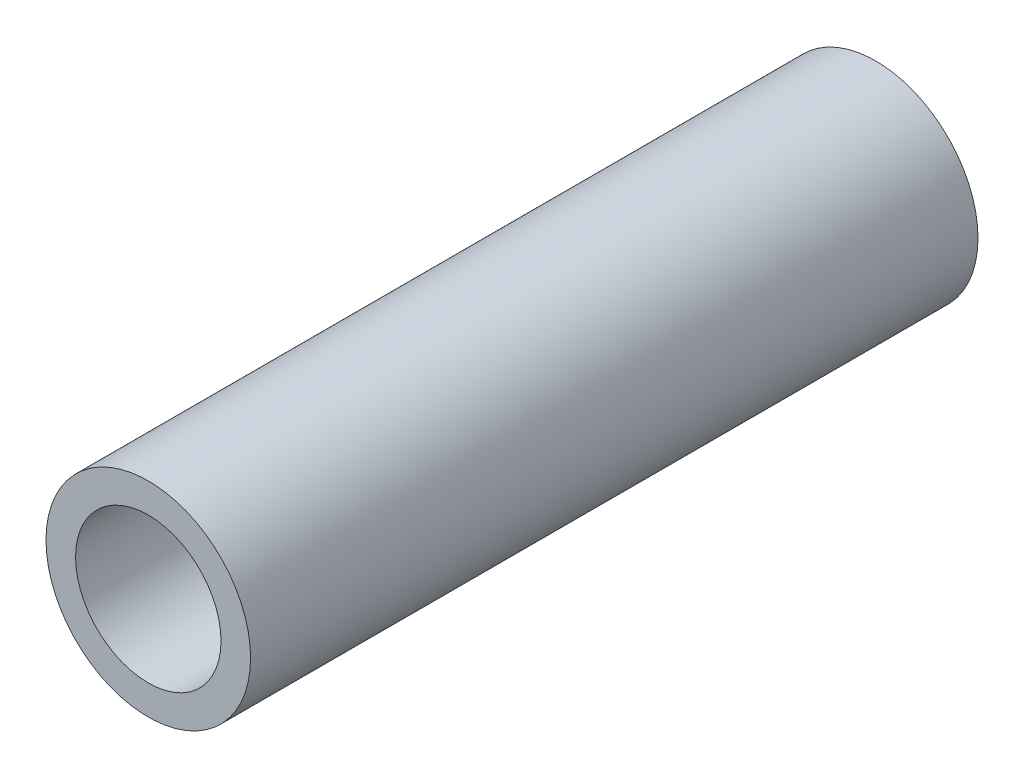
ISO-10303-21;
HEADER;
FILE_DESCRIPTION(('STEP AP214'),'2;1');
FILE_NAME('part.step','',(''),(''),'','','');
FILE_SCHEMA(('AUTOMOTIVE_DESIGN { 1 0 10303 214 1 1 1 1 }'));
ENDSEC;
DATA;
#1=APPLICATION_CONTEXT('core data for automotive mechanical design processes');
#2=APPLICATION_PROTOCOL_DEFINITION('international standard','automotive_design',2000,#1);
#3=PRODUCT_CONTEXT('',#1,'mechanical');
#4=PRODUCT('Part','Part','',(#3));
#5=PRODUCT_RELATED_PRODUCT_CATEGORY('part','',(#4));
#6=PRODUCT_DEFINITION_FORMATION('','',#4);
#7=PRODUCT_DEFINITION_CONTEXT('part definition',#1,'design');
#8=PRODUCT_DEFINITION('design','',#6,#7);
#9=PRODUCT_DEFINITION_SHAPE('','',#8);
#10=(LENGTH_UNIT() NAMED_UNIT(*) SI_UNIT(.MILLI.,.METRE.));
#11=(NAMED_UNIT(*) PLANE_ANGLE_UNIT() SI_UNIT($,.RADIAN.));
#12=(NAMED_UNIT(*) SI_UNIT($,.STERADIAN.) SOLID_ANGLE_UNIT());
#13=UNCERTAINTY_MEASURE_WITH_UNIT(LENGTH_MEASURE(1.E-05),#10,'distance_accuracy_value','');
#14=(GEOMETRIC_REPRESENTATION_CONTEXT(3) GLOBAL_UNCERTAINTY_ASSIGNED_CONTEXT((#13)) GLOBAL_UNIT_ASSIGNED_CONTEXT((#10,
#11,#12)) REPRESENTATION_CONTEXT('',''));
#15=CARTESIAN_POINT('',(0.,0.,0.));
#16=DIRECTION('',(0.,0.,1.));
#17=DIRECTION('',(1.,0.,0.));
#18=AXIS2_PLACEMENT_3D('',#15,#16,#17);
#19=CARTESIAN_POINT('',(0.,0.,8.));
#20=DIRECTION('',(0.,0.,-1.));
#21=DIRECTION('',(-1.,0.,0.));
#22=AXIS2_PLACEMENT_3D('',#19,#20,#21);
#23=CYLINDRICAL_SURFACE('',#22,1.6);
#24=CARTESIAN_POINT('',(0.,0.,8.));
#25=DIRECTION('',(0.,0.,1.));
#26=DIRECTION('',(1.,0.,0.));
#27=AXIS2_PLACEMENT_3D('',#24,#25,#26);
#28=CIRCLE('',#27,1.6);
#29=CARTESIAN_POINT('',(-1.6,0.,8.));
#30=VERTEX_POINT('',#29);
#31=CARTESIAN_POINT('',(1.6,0.,8.));
#32=VERTEX_POINT('',#31);
#33=EDGE_CURVE('E10',#30,#32,#28,.T.);
#34=ORIENTED_EDGE('',*,*,#33,.T.);
#35=DIRECTION('',(0.,0.,-1.));
#36=VECTOR('',#35,1.);
#37=CARTESIAN_POINT('',(1.6,0.,8.));
#38=LINE('',#37,#36);
#39=CARTESIAN_POINT('',(1.6,0.,-8.));
#40=VERTEX_POINT('',#39);
#41=EDGE_CURVE('E26',#32,#40,#38,.T.);
#42=ORIENTED_EDGE('',*,*,#41,.T.);
#43=CARTESIAN_POINT('',(0.,0.,-8.));
#44=DIRECTION('',(0.,0.,1.));
#45=DIRECTION('',(1.,0.,0.));
#46=AXIS2_PLACEMENT_3D('',#43,#44,#45);
#47=CIRCLE('',#46,1.6);
#48=CARTESIAN_POINT('',(-1.6,0.,-8.));
#49=VERTEX_POINT('',#48);
#50=EDGE_CURVE('E49',#49,#40,#47,.T.);
#51=ORIENTED_EDGE('',*,*,#50,.F.);
#52=CARTESIAN_POINT('',(0.,0.,-8.));
#53=DIRECTION('',(0.,0.,1.));
#54=DIRECTION('',(1.,0.,0.));
#55=AXIS2_PLACEMENT_3D('',#52,#53,#54);
#56=CIRCLE('',#55,1.6);
#57=EDGE_CURVE('E101',#40,#49,#56,.T.);
#58=ORIENTED_EDGE('',*,*,#57,.F.);
#59=ORIENTED_EDGE('',*,*,#41,.F.);
#60=CARTESIAN_POINT('',(0.,0.,8.));
#61=DIRECTION('',(0.,0.,1.));
#62=DIRECTION('',(1.,0.,0.));
#63=AXIS2_PLACEMENT_3D('',#60,#61,#62);
#64=CIRCLE('',#63,1.6);
#65=EDGE_CURVE('E88',#32,#30,#64,.T.);
#66=ORIENTED_EDGE('',*,*,#65,.T.);
#67=EDGE_LOOP('',(#34,#42,#51,#58,#59,#66));
#68=FACE_BOUND('',#67,.T.);
#69=ADVANCED_FACE('F16',(#68),#23,.F.);
#70=CARTESIAN_POINT('',(0.,0.,8.));
#71=DIRECTION('',(0.,0.,-1.));
#72=DIRECTION('',(-1.,0.,0.));
#73=AXIS2_PLACEMENT_3D('',#70,#71,#72);
#74=CYLINDRICAL_SURFACE('',#73,2.25);
#75=CARTESIAN_POINT('',(0.,0.,-8.));
#76=DIRECTION('',(0.,0.,1.));
#77=DIRECTION('',(1.,0.,0.));
#78=AXIS2_PLACEMENT_3D('',#75,#76,#77);
#79=CIRCLE('',#78,2.25);
#80=CARTESIAN_POINT('',(-2.25,0.,-8.));
#81=VERTEX_POINT('',#80);
#82=CARTESIAN_POINT('',(2.25,0.,-8.));
#83=VERTEX_POINT('',#82);
#84=EDGE_CURVE('E83',#81,#83,#79,.T.);
#85=ORIENTED_EDGE('',*,*,#84,.T.);
#86=DIRECTION('',(0.,0.,1.));
#87=VECTOR('',#86,1.);
#88=CARTESIAN_POINT('',(2.25,0.,8.));
#89=LINE('',#88,#87);
#90=CARTESIAN_POINT('',(2.25,0.,8.));
#91=VERTEX_POINT('',#90);
#92=EDGE_CURVE('E77',#83,#91,#89,.T.);
#93=ORIENTED_EDGE('',*,*,#92,.T.);
#94=CARTESIAN_POINT('',(0.,0.,8.));
#95=DIRECTION('',(0.,0.,1.));
#96=DIRECTION('',(1.,0.,0.));
#97=AXIS2_PLACEMENT_3D('',#94,#95,#96);
#98=CIRCLE('',#97,2.25);
#99=CARTESIAN_POINT('',(-2.25,0.,8.));
#100=VERTEX_POINT('',#99);
#101=EDGE_CURVE('E67',#100,#91,#98,.T.);
#102=ORIENTED_EDGE('',*,*,#101,.F.);
#103=CARTESIAN_POINT('',(0.,0.,8.));
#104=DIRECTION('',(0.,0.,1.));
#105=DIRECTION('',(1.,0.,0.));
#106=AXIS2_PLACEMENT_3D('',#103,#104,#105);
#107=CIRCLE('',#106,2.25);
#108=EDGE_CURVE('E81',#91,#100,#107,.T.);
#109=ORIENTED_EDGE('',*,*,#108,.F.);
#110=ORIENTED_EDGE('',*,*,#92,.F.);
#111=CARTESIAN_POINT('',(0.,0.,-8.));
#112=DIRECTION('',(0.,0.,1.));
#113=DIRECTION('',(1.,0.,0.));
#114=AXIS2_PLACEMENT_3D('',#111,#112,#113);
#115=CIRCLE('',#114,2.25);
#116=EDGE_CURVE('E20',#83,#81,#115,.T.);
#117=ORIENTED_EDGE('',*,*,#116,.T.);
#118=EDGE_LOOP('',(#85,#93,#102,#109,#110,#117));
#119=FACE_BOUND('',#118,.T.);
#120=ADVANCED_FACE('F79',(#119),#74,.T.);
#121=CARTESIAN_POINT('',(0.,0.,8.));
#122=DIRECTION('',(0.,0.,1.));
#123=DIRECTION('',(1.,0.,0.));
#124=AXIS2_PLACEMENT_3D('',#121,#122,#123);
#125=PLANE('',#124);
#126=ORIENTED_EDGE('',*,*,#101,.T.);
#127=ORIENTED_EDGE('',*,*,#108,.T.);
#128=EDGE_LOOP('',(#126,#127));
#129=FACE_BOUND('',#128,.T.);
#130=ORIENTED_EDGE('',*,*,#33,.F.);
#131=ORIENTED_EDGE('',*,*,#65,.F.);
#132=EDGE_LOOP('',(#130,#131));
#133=FACE_BOUND('',#132,.T.);
#134=ADVANCED_FACE('F18',(#129,#133),#125,.T.);
#135=CARTESIAN_POINT('',(0.,0.,-8.));
#136=DIRECTION('',(0.,0.,1.));
#137=DIRECTION('',(1.,0.,0.));
#138=AXIS2_PLACEMENT_3D('',#135,#136,#137);
#139=PLANE('',#138);
#140=ORIENTED_EDGE('',*,*,#84,.F.);
#141=ORIENTED_EDGE('',*,*,#116,.F.);
#142=EDGE_LOOP('',(#140,#141));
#143=FACE_BOUND('',#142,.T.);
#144=ORIENTED_EDGE('',*,*,#50,.T.);
#145=ORIENTED_EDGE('',*,*,#57,.T.);
#146=EDGE_LOOP('',(#144,#145));
#147=FACE_BOUND('',#146,.T.);
#148=ADVANCED_FACE('F89',(#143,#147),#139,.F.);
#149=CLOSED_SHELL('',(#69,#120,#134,#148));
#150=MANIFOLD_SOLID_BREP('B1',#149);
#151=ADVANCED_BREP_SHAPE_REPRESENTATION('',(#18,#150),#14);
#152=SHAPE_DEFINITION_REPRESENTATION(#9,#151);
ENDSEC;
END-ISO-10303-21;
